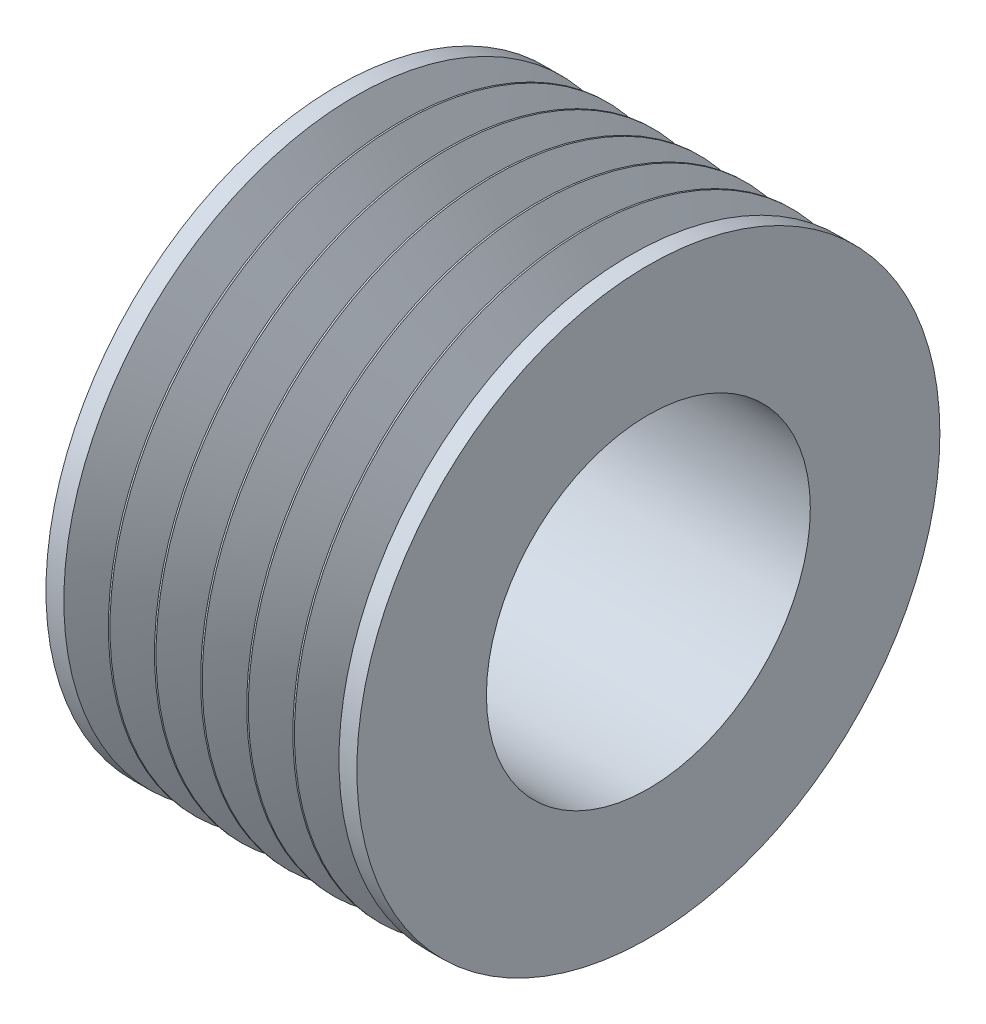
ISO-10303-21;
HEADER;
FILE_DESCRIPTION(('STEP AP214'),'2;1');
FILE_NAME('part.step','',(''),(''),'','','');
FILE_SCHEMA(('AUTOMOTIVE_DESIGN { 1 0 10303 214 1 1 1 1 }'));
ENDSEC;
DATA;
#1=APPLICATION_CONTEXT('core data for automotive mechanical design processes');
#2=APPLICATION_PROTOCOL_DEFINITION('international standard','automotive_design',2000,#1);
#3=PRODUCT_CONTEXT('',#1,'mechanical');
#4=PRODUCT('Part','Part','',(#3));
#5=PRODUCT_RELATED_PRODUCT_CATEGORY('part','',(#4));
#6=PRODUCT_DEFINITION_FORMATION('','',#4);
#7=PRODUCT_DEFINITION_CONTEXT('part definition',#1,'design');
#8=PRODUCT_DEFINITION('design','',#6,#7);
#9=PRODUCT_DEFINITION_SHAPE('','',#8);
#10=(LENGTH_UNIT() NAMED_UNIT(*) SI_UNIT(.MILLI.,.METRE.));
#11=(NAMED_UNIT(*) PLANE_ANGLE_UNIT() SI_UNIT($,.RADIAN.));
#12=(NAMED_UNIT(*) SI_UNIT($,.STERADIAN.) SOLID_ANGLE_UNIT());
#13=UNCERTAINTY_MEASURE_WITH_UNIT(LENGTH_MEASURE(1.E-05),#10,'distance_accuracy_value','');
#14=(GEOMETRIC_REPRESENTATION_CONTEXT(3) GLOBAL_UNCERTAINTY_ASSIGNED_CONTEXT((#13)) GLOBAL_UNIT_ASSIGNED_CONTEXT((#10,
#11,#12)) REPRESENTATION_CONTEXT('',''));
#15=CARTESIAN_POINT('',(0.,0.,0.));
#16=DIRECTION('',(0.,0.,1.));
#17=DIRECTION('',(1.,0.,0.));
#18=AXIS2_PLACEMENT_3D('',#15,#16,#17);
#19=CARTESIAN_POINT('',(63.7548994241449,0.,0.));
#20=DIRECTION('',(1.,0.,0.));
#21=DIRECTION('',(0.,0.,-1.));
#22=AXIS2_PLACEMENT_3D('',#19,#20,#21);
#23=CYLINDRICAL_SURFACE('',#22,22.5);
#24=CARTESIAN_POINT('',(-1.38000000000001,0.,0.));
#25=DIRECTION('',(1.,0.,0.));
#26=DIRECTION('',(0.,0.,-1.));
#27=AXIS2_PLACEMENT_3D('',#24,#25,#26);
#28=CIRCLE('',#27,22.5);
#29=CARTESIAN_POINT('',(-1.38000000000001,0.,-22.5));
#30=VERTEX_POINT('',#29);
#31=EDGE_CURVE('E128',#30,#30,#28,.T.);
#32=ORIENTED_EDGE('',*,*,#31,.T.);
#33=EDGE_LOOP('',(#32));
#34=FACE_BOUND('',#33,.T.);
#35=CARTESIAN_POINT('',(0.,0.,0.));
#36=DIRECTION('',(1.,0.,0.));
#37=DIRECTION('',(0.,0.,-1.));
#38=AXIS2_PLACEMENT_3D('',#35,#36,#37);
#39=CIRCLE('',#38,22.5);
#40=CARTESIAN_POINT('',(0.,0.,-22.5));
#41=VERTEX_POINT('',#40);
#42=EDGE_CURVE('E12',#41,#41,#39,.T.);
#43=ORIENTED_EDGE('',*,*,#42,.F.);
#44=EDGE_LOOP('',(#43));
#45=FACE_BOUND('',#44,.T.);
#46=ADVANCED_FACE('F40',(#34,#45),#23,.T.);
#47=CARTESIAN_POINT('',(0.,22.5,0.));
#48=DIRECTION('',(1.,0.,0.));
#49=DIRECTION('',(0.,0.,-1.));
#50=AXIS2_PLACEMENT_3D('',#47,#48,#49);
#51=PLANE('',#50);
#52=ORIENTED_EDGE('',*,*,#42,.T.);
#53=EDGE_LOOP('',(#52));
#54=FACE_BOUND('',#53,.T.);
#55=CARTESIAN_POINT('',(0.,0.,0.));
#56=DIRECTION('',(1.,0.,0.));
#57=DIRECTION('',(0.,0.,-1.));
#58=AXIS2_PLACEMENT_3D('',#55,#56,#57);
#59=CIRCLE('',#58,12.5);
#60=CARTESIAN_POINT('',(0.,0.,-12.5));
#61=VERTEX_POINT('',#60);
#62=EDGE_CURVE('E46',#61,#61,#59,.T.);
#63=ORIENTED_EDGE('',*,*,#62,.F.);
#64=EDGE_LOOP('',(#63));
#65=FACE_BOUND('',#64,.T.);
#66=ADVANCED_FACE('F146',(#54,#65),#51,.T.);
#67=CARTESIAN_POINT('',(63.7548994241449,0.,0.));
#68=DIRECTION('',(1.,0.,0.));
#69=DIRECTION('',(0.,0.,-1.));
#70=AXIS2_PLACEMENT_3D('',#67,#68,#69);
#71=CYLINDRICAL_SURFACE('',#70,12.5);
#72=ORIENTED_EDGE('',*,*,#62,.T.);
#73=EDGE_LOOP('',(#72));
#74=FACE_BOUND('',#73,.T.);
#75=CARTESIAN_POINT('',(-23.9957425336415,0.,0.));
#76=DIRECTION('',(1.,0.,0.));
#77=DIRECTION('',(0.,0.,-1.));
#78=AXIS2_PLACEMENT_3D('',#75,#76,#77);
#79=CIRCLE('',#78,12.5);
#80=CARTESIAN_POINT('',(-23.9957425336415,0.,-12.5));
#81=VERTEX_POINT('',#80);
#82=EDGE_CURVE('E50',#81,#81,#79,.T.);
#83=ORIENTED_EDGE('',*,*,#82,.F.);
#84=EDGE_LOOP('',(#83));
#85=FACE_BOUND('',#84,.T.);
#86=ADVANCED_FACE('F150',(#74,#85),#71,.F.);
#87=CARTESIAN_POINT('',(-23.9957425336415,22.5000000000001,0.));
#88=DIRECTION('',(-1.,0.,0.));
#89=DIRECTION('',(0.,0.,1.));
#90=AXIS2_PLACEMENT_3D('',#87,#88,#89);
#91=PLANE('',#90);
#92=ORIENTED_EDGE('',*,*,#82,.T.);
#93=EDGE_LOOP('',(#92));
#94=FACE_BOUND('',#93,.T.);
#95=CARTESIAN_POINT('',(-23.9957425336415,0.,0.));
#96=DIRECTION('',(1.,0.,0.));
#97=DIRECTION('',(0.,0.,-1.));
#98=AXIS2_PLACEMENT_3D('',#95,#96,#97);
#99=CIRCLE('',#98,22.5);
#100=CARTESIAN_POINT('',(-23.9957425336415,0.,-22.5));
#101=VERTEX_POINT('',#100);
#102=EDGE_CURVE('E54',#101,#101,#99,.T.);
#103=ORIENTED_EDGE('',*,*,#102,.F.);
#104=EDGE_LOOP('',(#103));
#105=FACE_BOUND('',#104,.T.);
#106=ADVANCED_FACE('F154',(#94,#105),#91,.T.);
#107=CARTESIAN_POINT('',(63.7548994241449,0.,0.));
#108=DIRECTION('',(1.,0.,0.));
#109=DIRECTION('',(0.,0.,-1.));
#110=AXIS2_PLACEMENT_3D('',#107,#108,#109);
#111=CYLINDRICAL_SURFACE('',#110,22.5);
#112=ORIENTED_EDGE('',*,*,#102,.T.);
#113=EDGE_LOOP('',(#112));
#114=FACE_BOUND('',#113,.T.);
#115=CARTESIAN_POINT('',(-22.6157425336415,0.,0.));
#116=DIRECTION('',(1.,0.,0.));
#117=DIRECTION('',(0.,0.,-1.));
#118=AXIS2_PLACEMENT_3D('',#115,#116,#117);
#119=CIRCLE('',#118,22.5);
#120=CARTESIAN_POINT('',(-22.6157425336415,0.,-22.5));
#121=VERTEX_POINT('',#120);
#122=EDGE_CURVE('E59',#121,#121,#119,.T.);
#123=ORIENTED_EDGE('',*,*,#122,.F.);
#124=EDGE_LOOP('',(#123));
#125=FACE_BOUND('',#124,.T.);
#126=ADVANCED_FACE('F160',(#114,#125),#111,.T.);
#127=CARTESIAN_POINT('',(-21.0752734334564,0.,0.));
#128=DIRECTION('',(-1.,0.,0.));
#129=DIRECTION('',(0.,0.,1.));
#130=AXIS2_PLACEMENT_3D('',#127,#128,#129);
#131=CONICAL_SURFACE('',#130,19.540786391393,1.09083078249646);
#132=ORIENTED_EDGE('',*,*,#122,.T.);
#133=EDGE_LOOP('',(#132));
#134=FACE_BOUND('',#133,.T.);
#135=CARTESIAN_POINT('',(-21.0752734334564,0.,0.));
#136=DIRECTION('',(1.,0.,0.));
#137=DIRECTION('',(0.,0.,-1.));
#138=AXIS2_PLACEMENT_3D('',#135,#136,#137);
#139=CIRCLE('',#138,19.540786391393);
#140=CARTESIAN_POINT('',(-21.0752734334564,0.,-19.5407863913931));
#141=VERTEX_POINT('',#140);
#142=EDGE_CURVE('E62',#141,#141,#139,.T.);
#143=ORIENTED_EDGE('',*,*,#142,.F.);
#144=EDGE_LOOP('',(#143));
#145=FACE_BOUND('',#144,.T.);
#146=ADVANCED_FACE('F164',(#134,#145),#131,.T.);
#147=CARTESIAN_POINT('',(-20.8978712668207,0.,0.));
#148=DIRECTION('',(1.,0.,0.));
#149=DIRECTION('',(0.,0.,-1.));
#150=AXIS2_PLACEMENT_3D('',#147,#148,#149);
#151=TOROIDAL_SURFACE('',#150,19.63313611404,0.200000000000001);
#152=ORIENTED_EDGE('',*,*,#142,.T.);
#153=EDGE_LOOP('',(#152));
#154=FACE_BOUND('',#153,.T.);
#155=CARTESIAN_POINT('',(-20.7204691001851,0.,0.));
#156=DIRECTION('',(1.,0.,0.));
#157=DIRECTION('',(0.,0.,-1.));
#158=AXIS2_PLACEMENT_3D('',#155,#156,#157);
#159=CIRCLE('',#158,19.540786391393);
#160=CARTESIAN_POINT('',(-20.7204691001851,0.,-19.5407863913931));
#161=VERTEX_POINT('',#160);
#162=EDGE_CURVE('E65',#161,#161,#159,.T.);
#163=ORIENTED_EDGE('',*,*,#162,.F.);
#164=EDGE_LOOP('',(#163));
#165=FACE_BOUND('',#164,.T.);
#166=ADVANCED_FACE('F168',(#154,#165),#151,.F.);
#167=CARTESIAN_POINT('',(-19.18,0.,0.));
#168=DIRECTION('',(1.,0.,0.));
#169=DIRECTION('',(0.,0.,-1.));
#170=AXIS2_PLACEMENT_3D('',#167,#168,#169);
#171=CONICAL_SURFACE('',#170,22.5,1.09083078249646);
#172=ORIENTED_EDGE('',*,*,#162,.T.);
#173=EDGE_LOOP('',(#172));
#174=FACE_BOUND('',#173,.T.);
#175=CARTESIAN_POINT('',(-19.18,0.,0.));
#176=DIRECTION('',(1.,0.,0.));
#177=DIRECTION('',(0.,0.,-1.));
#178=AXIS2_PLACEMENT_3D('',#175,#176,#177);
#179=CIRCLE('',#178,22.5);
#180=CARTESIAN_POINT('',(-19.18,0.,-22.5));
#181=VERTEX_POINT('',#180);
#182=EDGE_CURVE('E68',#181,#181,#179,.T.);
#183=ORIENTED_EDGE('',*,*,#182,.F.);
#184=EDGE_LOOP('',(#183));
#185=FACE_BOUND('',#184,.T.);
#186=ADVANCED_FACE('F172',(#174,#185),#171,.T.);
#187=CARTESIAN_POINT('',(63.7548994241449,0.,0.));
#188=DIRECTION('',(1.,0.,0.));
#189=DIRECTION('',(0.,0.,-1.));
#190=AXIS2_PLACEMENT_3D('',#187,#188,#189);
#191=CYLINDRICAL_SURFACE('',#190,22.5);
#192=ORIENTED_EDGE('',*,*,#182,.T.);
#193=EDGE_LOOP('',(#192));
#194=FACE_BOUND('',#193,.T.);
#195=CARTESIAN_POINT('',(-19.0557425336415,0.,0.));
#196=DIRECTION('',(1.,0.,0.));
#197=DIRECTION('',(0.,0.,-1.));
#198=AXIS2_PLACEMENT_3D('',#195,#196,#197);
#199=CIRCLE('',#198,22.5);
#200=CARTESIAN_POINT('',(-19.0557425336415,0.,-22.5));
#201=VERTEX_POINT('',#200);
#202=EDGE_CURVE('E71',#201,#201,#199,.T.);
#203=ORIENTED_EDGE('',*,*,#202,.F.);
#204=EDGE_LOOP('',(#203));
#205=FACE_BOUND('',#204,.T.);
#206=ADVANCED_FACE('F176',(#194,#205),#191,.T.);
#207=CARTESIAN_POINT('',(-17.5152734334564,0.,0.));
#208=DIRECTION('',(-1.,0.,0.));
#209=DIRECTION('',(0.,0.,1.));
#210=AXIS2_PLACEMENT_3D('',#207,#208,#209);
#211=CONICAL_SURFACE('',#210,19.540786391393,1.09083078249646);
#212=ORIENTED_EDGE('',*,*,#202,.T.);
#213=EDGE_LOOP('',(#212));
#214=FACE_BOUND('',#213,.T.);
#215=CARTESIAN_POINT('',(-17.5152734334564,0.,0.));
#216=DIRECTION('',(1.,0.,0.));
#217=DIRECTION('',(0.,0.,-1.));
#218=AXIS2_PLACEMENT_3D('',#215,#216,#217);
#219=CIRCLE('',#218,19.540786391393);
#220=CARTESIAN_POINT('',(-17.5152734334564,0.,-19.5407863913931));
#221=VERTEX_POINT('',#220);
#222=EDGE_CURVE('E74',#221,#221,#219,.T.);
#223=ORIENTED_EDGE('',*,*,#222,.F.);
#224=EDGE_LOOP('',(#223));
#225=FACE_BOUND('',#224,.T.);
#226=ADVANCED_FACE('F180',(#214,#225),#211,.T.);
#227=CARTESIAN_POINT('',(-17.3378712668207,0.,0.));
#228=DIRECTION('',(1.,0.,0.));
#229=DIRECTION('',(0.,0.,-1.));
#230=AXIS2_PLACEMENT_3D('',#227,#228,#229);
#231=TOROIDAL_SURFACE('',#230,19.63313611404,0.200000000000001);
#232=ORIENTED_EDGE('',*,*,#222,.T.);
#233=EDGE_LOOP('',(#232));
#234=FACE_BOUND('',#233,.T.);
#235=CARTESIAN_POINT('',(-17.1604691001851,0.,0.));
#236=DIRECTION('',(1.,0.,0.));
#237=DIRECTION('',(0.,0.,-1.));
#238=AXIS2_PLACEMENT_3D('',#235,#236,#237);
#239=CIRCLE('',#238,19.540786391393);
#240=CARTESIAN_POINT('',(-17.1604691001851,0.,-19.5407863913931));
#241=VERTEX_POINT('',#240);
#242=EDGE_CURVE('E77',#241,#241,#239,.T.);
#243=ORIENTED_EDGE('',*,*,#242,.F.);
#244=EDGE_LOOP('',(#243));
#245=FACE_BOUND('',#244,.T.);
#246=ADVANCED_FACE('F184',(#234,#245),#231,.F.);
#247=CARTESIAN_POINT('',(-15.62,0.,0.));
#248=DIRECTION('',(1.,0.,0.));
#249=DIRECTION('',(0.,0.,-1.));
#250=AXIS2_PLACEMENT_3D('',#247,#248,#249);
#251=CONICAL_SURFACE('',#250,22.5,1.09083078249646);
#252=ORIENTED_EDGE('',*,*,#242,.T.);
#253=EDGE_LOOP('',(#252));
#254=FACE_BOUND('',#253,.T.);
#255=CARTESIAN_POINT('',(-15.62,0.,0.));
#256=DIRECTION('',(1.,0.,0.));
#257=DIRECTION('',(0.,0.,-1.));
#258=AXIS2_PLACEMENT_3D('',#255,#256,#257);
#259=CIRCLE('',#258,22.5);
#260=CARTESIAN_POINT('',(-15.62,0.,-22.5));
#261=VERTEX_POINT('',#260);
#262=EDGE_CURVE('E80',#261,#261,#259,.T.);
#263=ORIENTED_EDGE('',*,*,#262,.F.);
#264=EDGE_LOOP('',(#263));
#265=FACE_BOUND('',#264,.T.);
#266=ADVANCED_FACE('F188',(#254,#265),#251,.T.);
#267=CARTESIAN_POINT('',(63.7548994241449,0.,0.));
#268=DIRECTION('',(1.,0.,0.));
#269=DIRECTION('',(0.,0.,-1.));
#270=AXIS2_PLACEMENT_3D('',#267,#268,#269);
#271=CYLINDRICAL_SURFACE('',#270,22.5);
#272=ORIENTED_EDGE('',*,*,#262,.T.);
#273=EDGE_LOOP('',(#272));
#274=FACE_BOUND('',#273,.T.);
#275=CARTESIAN_POINT('',(-15.4957425336415,0.,0.));
#276=DIRECTION('',(1.,0.,0.));
#277=DIRECTION('',(0.,0.,-1.));
#278=AXIS2_PLACEMENT_3D('',#275,#276,#277);
#279=CIRCLE('',#278,22.5);
#280=CARTESIAN_POINT('',(-15.4957425336415,0.,-22.5));
#281=VERTEX_POINT('',#280);
#282=EDGE_CURVE('E83',#281,#281,#279,.T.);
#283=ORIENTED_EDGE('',*,*,#282,.F.);
#284=EDGE_LOOP('',(#283));
#285=FACE_BOUND('',#284,.T.);
#286=ADVANCED_FACE('F192',(#274,#285),#271,.T.);
#287=CARTESIAN_POINT('',(-13.9552734334564,0.,0.));
#288=DIRECTION('',(-1.,0.,0.));
#289=DIRECTION('',(0.,0.,1.));
#290=AXIS2_PLACEMENT_3D('',#287,#288,#289);
#291=CONICAL_SURFACE('',#290,19.540786391393,1.09083078249646);
#292=ORIENTED_EDGE('',*,*,#282,.T.);
#293=EDGE_LOOP('',(#292));
#294=FACE_BOUND('',#293,.T.);
#295=CARTESIAN_POINT('',(-13.9552734334564,0.,0.));
#296=DIRECTION('',(1.,0.,0.));
#297=DIRECTION('',(0.,0.,-1.));
#298=AXIS2_PLACEMENT_3D('',#295,#296,#297);
#299=CIRCLE('',#298,19.540786391393);
#300=CARTESIAN_POINT('',(-13.9552734334564,0.,-19.5407863913931));
#301=VERTEX_POINT('',#300);
#302=EDGE_CURVE('E86',#301,#301,#299,.T.);
#303=ORIENTED_EDGE('',*,*,#302,.F.);
#304=EDGE_LOOP('',(#303));
#305=FACE_BOUND('',#304,.T.);
#306=ADVANCED_FACE('F196',(#294,#305),#291,.T.);
#307=CARTESIAN_POINT('',(-13.7778712668207,0.,0.));
#308=DIRECTION('',(1.,0.,0.));
#309=DIRECTION('',(0.,0.,-1.));
#310=AXIS2_PLACEMENT_3D('',#307,#308,#309);
#311=TOROIDAL_SURFACE('',#310,19.6331361140401,0.2);
#312=ORIENTED_EDGE('',*,*,#302,.T.);
#313=EDGE_LOOP('',(#312));
#314=FACE_BOUND('',#313,.T.);
#315=CARTESIAN_POINT('',(-13.6004691001851,0.,0.));
#316=DIRECTION('',(1.,0.,0.));
#317=DIRECTION('',(0.,0.,-1.));
#318=AXIS2_PLACEMENT_3D('',#315,#316,#317);
#319=CIRCLE('',#318,19.540786391393);
#320=CARTESIAN_POINT('',(-13.6004691001851,0.,-19.5407863913931));
#321=VERTEX_POINT('',#320);
#322=EDGE_CURVE('E89',#321,#321,#319,.T.);
#323=ORIENTED_EDGE('',*,*,#322,.F.);
#324=EDGE_LOOP('',(#323));
#325=FACE_BOUND('',#324,.T.);
#326=ADVANCED_FACE('F200',(#314,#325),#311,.F.);
#327=CARTESIAN_POINT('',(-12.06,0.,0.));
#328=DIRECTION('',(1.,0.,0.));
#329=DIRECTION('',(0.,0.,-1.));
#330=AXIS2_PLACEMENT_3D('',#327,#328,#329);
#331=CONICAL_SURFACE('',#330,22.5,1.09083078249646);
#332=ORIENTED_EDGE('',*,*,#322,.T.);
#333=EDGE_LOOP('',(#332));
#334=FACE_BOUND('',#333,.T.);
#335=CARTESIAN_POINT('',(-12.06,0.,0.));
#336=DIRECTION('',(1.,0.,0.));
#337=DIRECTION('',(0.,0.,-1.));
#338=AXIS2_PLACEMENT_3D('',#335,#336,#337);
#339=CIRCLE('',#338,22.5);
#340=CARTESIAN_POINT('',(-12.06,0.,-22.5));
#341=VERTEX_POINT('',#340);
#342=EDGE_CURVE('E92',#341,#341,#339,.T.);
#343=ORIENTED_EDGE('',*,*,#342,.F.);
#344=EDGE_LOOP('',(#343));
#345=FACE_BOUND('',#344,.T.);
#346=ADVANCED_FACE('F204',(#334,#345),#331,.T.);
#347=CARTESIAN_POINT('',(63.7548994241449,0.,0.));
#348=DIRECTION('',(1.,0.,0.));
#349=DIRECTION('',(0.,0.,-1.));
#350=AXIS2_PLACEMENT_3D('',#347,#348,#349);
#351=CYLINDRICAL_SURFACE('',#350,22.5);
#352=ORIENTED_EDGE('',*,*,#342,.T.);
#353=EDGE_LOOP('',(#352));
#354=FACE_BOUND('',#353,.T.);
#355=CARTESIAN_POINT('',(-11.9357425336415,0.,0.));
#356=DIRECTION('',(1.,0.,0.));
#357=DIRECTION('',(0.,0.,-1.));
#358=AXIS2_PLACEMENT_3D('',#355,#356,#357);
#359=CIRCLE('',#358,22.5);
#360=CARTESIAN_POINT('',(-11.9357425336415,0.,-22.5));
#361=VERTEX_POINT('',#360);
#362=EDGE_CURVE('E95',#361,#361,#359,.T.);
#363=ORIENTED_EDGE('',*,*,#362,.F.);
#364=EDGE_LOOP('',(#363));
#365=FACE_BOUND('',#364,.T.);
#366=ADVANCED_FACE('F208',(#354,#365),#351,.T.);
#367=CARTESIAN_POINT('',(-10.3952734334564,0.,0.));
#368=DIRECTION('',(-1.,0.,0.));
#369=DIRECTION('',(0.,0.,1.));
#370=AXIS2_PLACEMENT_3D('',#367,#368,#369);
#371=CONICAL_SURFACE('',#370,19.540786391393,1.09083078249646);
#372=ORIENTED_EDGE('',*,*,#362,.T.);
#373=EDGE_LOOP('',(#372));
#374=FACE_BOUND('',#373,.T.);
#375=CARTESIAN_POINT('',(-10.3952734334564,0.,0.));
#376=DIRECTION('',(1.,0.,0.));
#377=DIRECTION('',(0.,0.,-1.));
#378=AXIS2_PLACEMENT_3D('',#375,#376,#377);
#379=CIRCLE('',#378,19.540786391393);
#380=CARTESIAN_POINT('',(-10.3952734334564,0.,-19.5407863913931));
#381=VERTEX_POINT('',#380);
#382=EDGE_CURVE('E98',#381,#381,#379,.T.);
#383=ORIENTED_EDGE('',*,*,#382,.F.);
#384=EDGE_LOOP('',(#383));
#385=FACE_BOUND('',#384,.T.);
#386=ADVANCED_FACE('F212',(#374,#385),#371,.T.);
#387=CARTESIAN_POINT('',(-10.2178712668208,0.,0.));
#388=DIRECTION('',(1.,0.,0.));
#389=DIRECTION('',(0.,0.,-1.));
#390=AXIS2_PLACEMENT_3D('',#387,#388,#389);
#391=TOROIDAL_SURFACE('',#390,19.6331361140401,0.2);
#392=ORIENTED_EDGE('',*,*,#382,.T.);
#393=EDGE_LOOP('',(#392));
#394=FACE_BOUND('',#393,.T.);
#395=CARTESIAN_POINT('',(-10.0404691001851,0.,0.));
#396=DIRECTION('',(1.,0.,0.));
#397=DIRECTION('',(0.,0.,-1.));
#398=AXIS2_PLACEMENT_3D('',#395,#396,#397);
#399=CIRCLE('',#398,19.540786391393);
#400=CARTESIAN_POINT('',(-10.0404691001851,0.,-19.5407863913931));
#401=VERTEX_POINT('',#400);
#402=EDGE_CURVE('E101',#401,#401,#399,.T.);
#403=ORIENTED_EDGE('',*,*,#402,.F.);
#404=EDGE_LOOP('',(#403));
#405=FACE_BOUND('',#404,.T.);
#406=ADVANCED_FACE('F216',(#394,#405),#391,.F.);
#407=CARTESIAN_POINT('',(-8.49999999999999,0.,0.));
#408=DIRECTION('',(1.,0.,0.));
#409=DIRECTION('',(0.,0.,-1.));
#410=AXIS2_PLACEMENT_3D('',#407,#408,#409);
#411=CONICAL_SURFACE('',#410,22.5,1.09083078249646);
#412=ORIENTED_EDGE('',*,*,#402,.T.);
#413=EDGE_LOOP('',(#412));
#414=FACE_BOUND('',#413,.T.);
#415=CARTESIAN_POINT('',(-8.49999999999999,0.,0.));
#416=DIRECTION('',(1.,0.,0.));
#417=DIRECTION('',(0.,0.,-1.));
#418=AXIS2_PLACEMENT_3D('',#415,#416,#417);
#419=CIRCLE('',#418,22.5);
#420=CARTESIAN_POINT('',(-8.49999999999999,0.,-22.5));
#421=VERTEX_POINT('',#420);
#422=EDGE_CURVE('E104',#421,#421,#419,.T.);
#423=ORIENTED_EDGE('',*,*,#422,.F.);
#424=EDGE_LOOP('',(#423));
#425=FACE_BOUND('',#424,.T.);
#426=ADVANCED_FACE('F220',(#414,#425),#411,.T.);
#427=CARTESIAN_POINT('',(63.7548994241449,0.,0.));
#428=DIRECTION('',(1.,0.,0.));
#429=DIRECTION('',(0.,0.,-1.));
#430=AXIS2_PLACEMENT_3D('',#427,#428,#429);
#431=CYLINDRICAL_SURFACE('',#430,22.5);
#432=ORIENTED_EDGE('',*,*,#422,.T.);
#433=EDGE_LOOP('',(#432));
#434=FACE_BOUND('',#433,.T.);
#435=CARTESIAN_POINT('',(-8.37574253364151,0.,0.));
#436=DIRECTION('',(1.,0.,0.));
#437=DIRECTION('',(0.,0.,-1.));
#438=AXIS2_PLACEMENT_3D('',#435,#436,#437);
#439=CIRCLE('',#438,22.5);
#440=CARTESIAN_POINT('',(-8.37574253364151,0.,-22.5));
#441=VERTEX_POINT('',#440);
#442=EDGE_CURVE('E107',#441,#441,#439,.T.);
#443=ORIENTED_EDGE('',*,*,#442,.F.);
#444=EDGE_LOOP('',(#443));
#445=FACE_BOUND('',#444,.T.);
#446=ADVANCED_FACE('F224',(#434,#445),#431,.T.);
#447=CARTESIAN_POINT('',(-6.8352734334564,0.,0.));
#448=DIRECTION('',(-1.,0.,0.));
#449=DIRECTION('',(0.,0.,1.));
#450=AXIS2_PLACEMENT_3D('',#447,#448,#449);
#451=CONICAL_SURFACE('',#450,19.540786391393,1.09083078249646);
#452=ORIENTED_EDGE('',*,*,#442,.T.);
#453=EDGE_LOOP('',(#452));
#454=FACE_BOUND('',#453,.T.);
#455=CARTESIAN_POINT('',(-6.8352734334564,0.,0.));
#456=DIRECTION('',(1.,0.,0.));
#457=DIRECTION('',(0.,0.,-1.));
#458=AXIS2_PLACEMENT_3D('',#455,#456,#457);
#459=CIRCLE('',#458,19.540786391393);
#460=CARTESIAN_POINT('',(-6.8352734334564,0.,-19.5407863913931));
#461=VERTEX_POINT('',#460);
#462=EDGE_CURVE('E110',#461,#461,#459,.T.);
#463=ORIENTED_EDGE('',*,*,#462,.F.);
#464=EDGE_LOOP('',(#463));
#465=FACE_BOUND('',#464,.T.);
#466=ADVANCED_FACE('F228',(#454,#465),#451,.T.);
#467=CARTESIAN_POINT('',(-6.65787126682076,0.,0.));
#468=DIRECTION('',(1.,0.,0.));
#469=DIRECTION('',(0.,0.,-1.));
#470=AXIS2_PLACEMENT_3D('',#467,#468,#469);
#471=TOROIDAL_SURFACE('',#470,19.6331361140401,0.2);
#472=ORIENTED_EDGE('',*,*,#462,.T.);
#473=EDGE_LOOP('',(#472));
#474=FACE_BOUND('',#473,.T.);
#475=CARTESIAN_POINT('',(-6.48046910018511,0.,0.));
#476=DIRECTION('',(1.,0.,0.));
#477=DIRECTION('',(0.,0.,-1.));
#478=AXIS2_PLACEMENT_3D('',#475,#476,#477);
#479=CIRCLE('',#478,19.540786391393);
#480=CARTESIAN_POINT('',(-6.48046910018511,0.,-19.5407863913931));
#481=VERTEX_POINT('',#480);
#482=EDGE_CURVE('E113',#481,#481,#479,.T.);
#483=ORIENTED_EDGE('',*,*,#482,.F.);
#484=EDGE_LOOP('',(#483));
#485=FACE_BOUND('',#484,.T.);
#486=ADVANCED_FACE('F232',(#474,#485),#471,.F.);
#487=CARTESIAN_POINT('',(-4.94,0.,0.));
#488=DIRECTION('',(1.,0.,0.));
#489=DIRECTION('',(0.,0.,-1.));
#490=AXIS2_PLACEMENT_3D('',#487,#488,#489);
#491=CONICAL_SURFACE('',#490,22.5,1.09083078249646);
#492=ORIENTED_EDGE('',*,*,#482,.T.);
#493=EDGE_LOOP('',(#492));
#494=FACE_BOUND('',#493,.T.);
#495=CARTESIAN_POINT('',(-4.94,0.,0.));
#496=DIRECTION('',(1.,0.,0.));
#497=DIRECTION('',(0.,0.,-1.));
#498=AXIS2_PLACEMENT_3D('',#495,#496,#497);
#499=CIRCLE('',#498,22.5);
#500=CARTESIAN_POINT('',(-4.94,0.,-22.5));
#501=VERTEX_POINT('',#500);
#502=EDGE_CURVE('E116',#501,#501,#499,.T.);
#503=ORIENTED_EDGE('',*,*,#502,.F.);
#504=EDGE_LOOP('',(#503));
#505=FACE_BOUND('',#504,.T.);
#506=ADVANCED_FACE('F236',(#494,#505),#491,.T.);
#507=CARTESIAN_POINT('',(63.7548994241449,0.,0.));
#508=DIRECTION('',(1.,0.,0.));
#509=DIRECTION('',(0.,0.,-1.));
#510=AXIS2_PLACEMENT_3D('',#507,#508,#509);
#511=CYLINDRICAL_SURFACE('',#510,22.5);
#512=ORIENTED_EDGE('',*,*,#502,.T.);
#513=EDGE_LOOP('',(#512));
#514=FACE_BOUND('',#513,.T.);
#515=CARTESIAN_POINT('',(-4.8157425336415,0.,0.));
#516=DIRECTION('',(1.,0.,0.));
#517=DIRECTION('',(0.,0.,-1.));
#518=AXIS2_PLACEMENT_3D('',#515,#516,#517);
#519=CIRCLE('',#518,22.5);
#520=CARTESIAN_POINT('',(-4.8157425336415,0.,-22.5));
#521=VERTEX_POINT('',#520);
#522=EDGE_CURVE('E119',#521,#521,#519,.T.);
#523=ORIENTED_EDGE('',*,*,#522,.F.);
#524=EDGE_LOOP('',(#523));
#525=FACE_BOUND('',#524,.T.);
#526=ADVANCED_FACE('F240',(#514,#525),#511,.T.);
#527=CARTESIAN_POINT('',(-3.2752734334564,0.,0.));
#528=DIRECTION('',(-1.,0.,0.));
#529=DIRECTION('',(0.,0.,1.));
#530=AXIS2_PLACEMENT_3D('',#527,#528,#529);
#531=CONICAL_SURFACE('',#530,19.540786391393,1.09083078249646);
#532=ORIENTED_EDGE('',*,*,#522,.T.);
#533=EDGE_LOOP('',(#532));
#534=FACE_BOUND('',#533,.T.);
#535=CARTESIAN_POINT('',(-3.2752734334564,0.,0.));
#536=DIRECTION('',(1.,0.,0.));
#537=DIRECTION('',(0.,0.,-1.));
#538=AXIS2_PLACEMENT_3D('',#535,#536,#537);
#539=CIRCLE('',#538,19.540786391393);
#540=CARTESIAN_POINT('',(-3.2752734334564,0.,-19.5407863913931));
#541=VERTEX_POINT('',#540);
#542=EDGE_CURVE('E122',#541,#541,#539,.T.);
#543=ORIENTED_EDGE('',*,*,#542,.F.);
#544=EDGE_LOOP('',(#543));
#545=FACE_BOUND('',#544,.T.);
#546=ADVANCED_FACE('F142',(#534,#545),#531,.T.);
#547=CARTESIAN_POINT('',(-3.09787126682077,0.,0.));
#548=DIRECTION('',(1.,0.,0.));
#549=DIRECTION('',(0.,0.,-1.));
#550=AXIS2_PLACEMENT_3D('',#547,#548,#549);
#551=TOROIDAL_SURFACE('',#550,19.6331361140401,0.200000000000001);
#552=ORIENTED_EDGE('',*,*,#542,.T.);
#553=EDGE_LOOP('',(#552));
#554=FACE_BOUND('',#553,.T.);
#555=CARTESIAN_POINT('',(-2.92046910018512,0.,0.));
#556=DIRECTION('',(1.,0.,0.));
#557=DIRECTION('',(0.,0.,-1.));
#558=AXIS2_PLACEMENT_3D('',#555,#556,#557);
#559=CIRCLE('',#558,19.540786391393);
#560=CARTESIAN_POINT('',(-2.92046910018512,0.,-19.5407863913931));
#561=VERTEX_POINT('',#560);
#562=EDGE_CURVE('E125',#561,#561,#559,.T.);
#563=ORIENTED_EDGE('',*,*,#562,.F.);
#564=EDGE_LOOP('',(#563));
#565=FACE_BOUND('',#564,.T.);
#566=ADVANCED_FACE('F136',(#554,#565),#551,.F.);
#567=CARTESIAN_POINT('',(-1.38000000000001,0.,0.));
#568=DIRECTION('',(1.,0.,0.));
#569=DIRECTION('',(0.,0.,-1.));
#570=AXIS2_PLACEMENT_3D('',#567,#568,#569);
#571=CONICAL_SURFACE('',#570,22.5,1.09083078249646);
#572=ORIENTED_EDGE('',*,*,#562,.T.);
#573=EDGE_LOOP('',(#572));
#574=FACE_BOUND('',#573,.T.);
#575=ORIENTED_EDGE('',*,*,#31,.F.);
#576=EDGE_LOOP('',(#575));
#577=FACE_BOUND('',#576,.T.);
#578=ADVANCED_FACE('F134',(#574,#577),#571,.T.);
#579=CLOSED_SHELL('',(#46,#66,#86,#106,#126,#146,#166,#186,#206,#226,#246,#266,#286,#306,#326,
#346,#366,#386,#406,#426,#446,#466,#486,#506,#526,#546,#566,#578));
#580=MANIFOLD_SOLID_BREP('B2',#579);
#581=ADVANCED_BREP_SHAPE_REPRESENTATION('',(#18,#580),#14);
#582=SHAPE_DEFINITION_REPRESENTATION(#9,#581);
ENDSEC;
END-ISO-10303-21;
